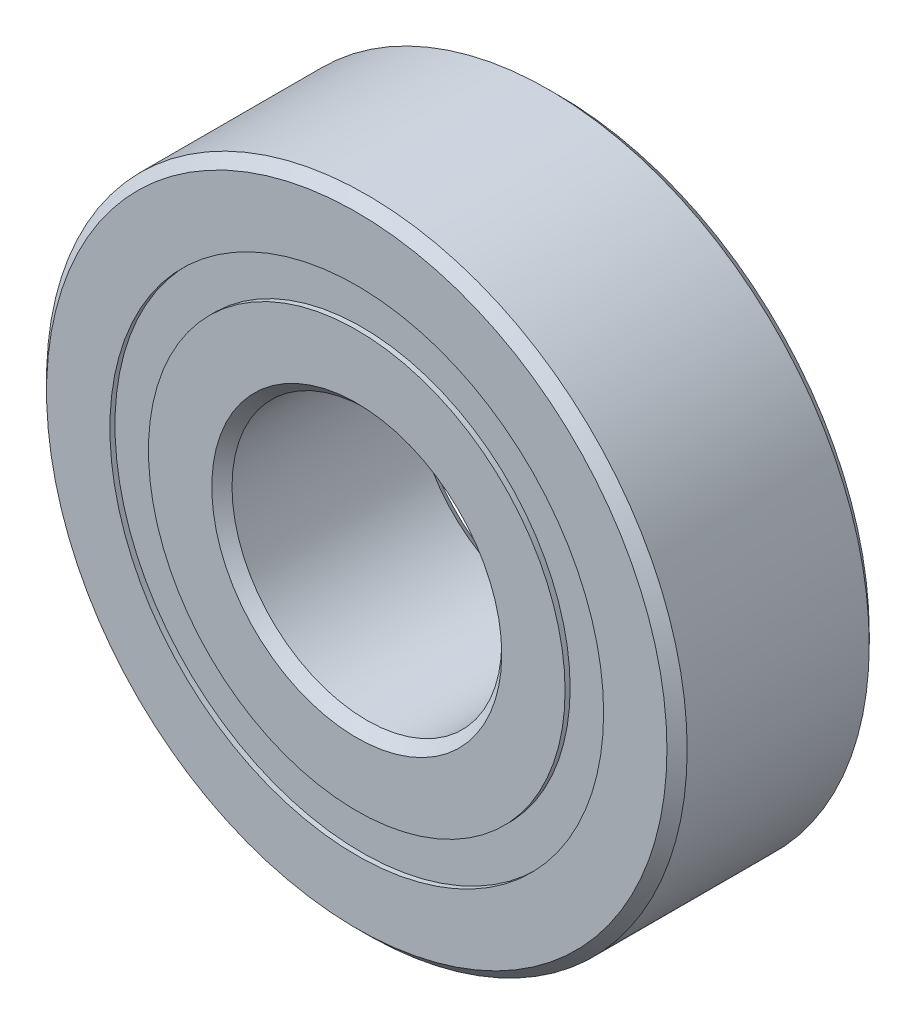
ISO-10303-21;
HEADER;
FILE_DESCRIPTION(('STEP AP214'),'2;1');
FILE_NAME('part.step','',(''),(''),'','','');
FILE_SCHEMA(('AUTOMOTIVE_DESIGN { 1 0 10303 214 1 1 1 1 }'));
ENDSEC;
DATA;
#1=APPLICATION_CONTEXT('core data for automotive mechanical design processes');
#2=APPLICATION_PROTOCOL_DEFINITION('international standard','automotive_design',2000,#1);
#3=PRODUCT_CONTEXT('',#1,'mechanical');
#4=PRODUCT('Part','Part','',(#3));
#5=PRODUCT_RELATED_PRODUCT_CATEGORY('part','',(#4));
#6=PRODUCT_DEFINITION_FORMATION('','',#4);
#7=PRODUCT_DEFINITION_CONTEXT('part definition',#1,'design');
#8=PRODUCT_DEFINITION('design','',#6,#7);
#9=PRODUCT_DEFINITION_SHAPE('','',#8);
#10=(LENGTH_UNIT() NAMED_UNIT(*) SI_UNIT(.MILLI.,.METRE.));
#11=(NAMED_UNIT(*) PLANE_ANGLE_UNIT() SI_UNIT($,.RADIAN.));
#12=(NAMED_UNIT(*) SI_UNIT($,.STERADIAN.) SOLID_ANGLE_UNIT());
#13=UNCERTAINTY_MEASURE_WITH_UNIT(LENGTH_MEASURE(1.E-05),#10,'distance_accuracy_value','');
#14=(GEOMETRIC_REPRESENTATION_CONTEXT(3) GLOBAL_UNCERTAINTY_ASSIGNED_CONTEXT((#13)) GLOBAL_UNIT_ASSIGNED_CONTEXT((#10,
#11,#12)) REPRESENTATION_CONTEXT('',''));
#15=CARTESIAN_POINT('',(0.,0.,0.));
#16=DIRECTION('',(0.,0.,1.));
#17=DIRECTION('',(1.,0.,0.));
#18=AXIS2_PLACEMENT_3D('',#15,#16,#17);
#19=CARTESIAN_POINT('',(0.,7.32142857142857,-2.85));
#20=DIRECTION('',(0.,0.,1.));
#21=DIRECTION('',(1.,0.,0.));
#22=AXIS2_PLACEMENT_3D('',#19,#20,#21);
#23=PLANE('',#22);
#24=CARTESIAN_POINT('',(0.,0.,-2.85));
#25=DIRECTION('',(0.,0.,1.));
#26=DIRECTION('',(1.,0.,0.));
#27=AXIS2_PLACEMENT_3D('',#24,#25,#26);
#28=CIRCLE('',#27,7.32142857142857);
#29=CARTESIAN_POINT('',(7.32142857142857,0.,-2.85));
#30=VERTEX_POINT('',#29);
#31=EDGE_CURVE('E55',#30,#30,#28,.T.);
#32=ORIENTED_EDGE('',*,*,#31,.F.);
#33=EDGE_LOOP('',(#32));
#34=FACE_BOUND('',#33,.T.);
#35=CARTESIAN_POINT('',(0.,0.,-2.85));
#36=DIRECTION('',(0.,0.,1.));
#37=DIRECTION('',(1.,0.,0.));
#38=AXIS2_PLACEMENT_3D('',#35,#36,#37);
#39=CIRCLE('',#38,6.17857142857143);
#40=CARTESIAN_POINT('',(6.17857142857143,0.,-2.85));
#41=VERTEX_POINT('',#40);
#42=EDGE_CURVE('E11',#41,#41,#39,.T.);
#43=ORIENTED_EDGE('',*,*,#42,.T.);
#44=EDGE_LOOP('',(#43));
#45=FACE_BOUND('',#44,.T.);
#46=ADVANCED_FACE('F41',(#34,#45),#23,.F.);
#47=CARTESIAN_POINT('',(0.,0.,3.));
#48=DIRECTION('',(0.,0.,1.));
#49=DIRECTION('',(1.,0.,0.));
#50=AXIS2_PLACEMENT_3D('',#47,#48,#49);
#51=CYLINDRICAL_SURFACE('',#50,6.17857142857143);
#52=ORIENTED_EDGE('',*,*,#42,.F.);
#53=EDGE_LOOP('',(#52));
#54=FACE_BOUND('',#53,.T.);
#55=CARTESIAN_POINT('',(0.,0.,-1.45062344873598));
#56=DIRECTION('',(0.,0.,1.));
#57=DIRECTION('',(1.,0.,0.));
#58=AXIS2_PLACEMENT_3D('',#55,#56,#57);
#59=CIRCLE('',#58,6.17857142857143);
#60=CARTESIAN_POINT('',(6.17857142857143,0.,-1.45062344873598));
#61=VERTEX_POINT('',#60);
#62=EDGE_CURVE('E47',#61,#61,#59,.T.);
#63=ORIENTED_EDGE('',*,*,#62,.T.);
#64=EDGE_LOOP('',(#63));
#65=FACE_BOUND('',#64,.T.);
#66=ADVANCED_FACE('F64',(#54,#65),#51,.F.);
#67=CARTESIAN_POINT('',(0.,7.32142857142857,-1.45062344873598));
#68=DIRECTION('',(0.,0.,-1.));
#69=DIRECTION('',(-1.,0.,0.));
#70=AXIS2_PLACEMENT_3D('',#67,#68,#69);
#71=PLANE('',#70);
#72=ORIENTED_EDGE('',*,*,#62,.F.);
#73=EDGE_LOOP('',(#72));
#74=FACE_BOUND('',#73,.T.);
#75=CARTESIAN_POINT('',(0.,0.,-1.45062344873598));
#76=DIRECTION('',(0.,0.,1.));
#77=DIRECTION('',(1.,0.,0.));
#78=AXIS2_PLACEMENT_3D('',#75,#76,#77);
#79=CIRCLE('',#78,7.32142857142857);
#80=CARTESIAN_POINT('',(7.32142857142857,0.,-1.45062344873598));
#81=VERTEX_POINT('',#80);
#82=EDGE_CURVE('E51',#81,#81,#79,.T.);
#83=ORIENTED_EDGE('',*,*,#82,.T.);
#84=EDGE_LOOP('',(#83));
#85=FACE_BOUND('',#84,.T.);
#86=ADVANCED_FACE('F68',(#74,#85),#71,.F.);
#87=CARTESIAN_POINT('',(0.,0.,3.));
#88=DIRECTION('',(0.,0.,1.));
#89=DIRECTION('',(1.,0.,0.));
#90=AXIS2_PLACEMENT_3D('',#87,#88,#89);
#91=CYLINDRICAL_SURFACE('',#90,7.32142857142857);
#92=ORIENTED_EDGE('',*,*,#82,.F.);
#93=EDGE_LOOP('',(#92));
#94=FACE_BOUND('',#93,.T.);
#95=ORIENTED_EDGE('',*,*,#31,.T.);
#96=EDGE_LOOP('',(#95));
#97=FACE_BOUND('',#96,.T.);
#98=ADVANCED_FACE('F61',(#94,#97),#91,.T.);
#99=CLOSED_SHELL('',(#46,#66,#86,#98));
#100=MANIFOLD_SOLID_BREP('B2',#99);
#101=CARTESIAN_POINT('',(0.,7.32142857142857,2.85));
#102=DIRECTION('',(0.,0.,-1.));
#103=DIRECTION('',(-1.,0.,0.));
#104=AXIS2_PLACEMENT_3D('',#101,#102,#103);
#105=PLANE('',#104);
#106=CARTESIAN_POINT('',(0.,0.,2.85));
#107=DIRECTION('',(0.,0.,1.));
#108=DIRECTION('',(1.,0.,0.));
#109=AXIS2_PLACEMENT_3D('',#106,#107,#108);
#110=CIRCLE('',#109,6.17857142857143);
#111=CARTESIAN_POINT('',(6.17857142857143,0.,2.85));
#112=VERTEX_POINT('',#111);
#113=EDGE_CURVE('E40',#112,#112,#110,.T.);
#114=ORIENTED_EDGE('',*,*,#113,.F.);
#115=EDGE_LOOP('',(#114));
#116=FACE_BOUND('',#115,.T.);
#117=CARTESIAN_POINT('',(0.,0.,2.85));
#118=DIRECTION('',(0.,0.,1.));
#119=DIRECTION('',(1.,0.,0.));
#120=AXIS2_PLACEMENT_3D('',#117,#118,#119);
#121=CIRCLE('',#120,7.32142857142857);
#122=CARTESIAN_POINT('',(7.32142857142857,0.,2.85));
#123=VERTEX_POINT('',#122);
#124=EDGE_CURVE('E122',#123,#123,#121,.T.);
#125=ORIENTED_EDGE('',*,*,#124,.T.);
#126=EDGE_LOOP('',(#125));
#127=FACE_BOUND('',#126,.T.);
#128=ADVANCED_FACE('F108',(#116,#127),#105,.F.);
#129=CARTESIAN_POINT('',(0.,0.,3.));
#130=DIRECTION('',(0.,0.,1.));
#131=DIRECTION('',(1.,0.,0.));
#132=AXIS2_PLACEMENT_3D('',#129,#130,#131);
#133=CYLINDRICAL_SURFACE('',#132,6.17857142857143);
#134=CARTESIAN_POINT('',(0.,0.,1.45062344873598));
#135=DIRECTION('',(0.,0.,1.));
#136=DIRECTION('',(1.,0.,0.));
#137=AXIS2_PLACEMENT_3D('',#134,#135,#136);
#138=CIRCLE('',#137,6.17857142857143);
#139=CARTESIAN_POINT('',(6.17857142857143,0.,1.45062344873598));
#140=VERTEX_POINT('',#139);
#141=EDGE_CURVE('E114',#140,#140,#138,.T.);
#142=ORIENTED_EDGE('',*,*,#141,.F.);
#143=EDGE_LOOP('',(#142));
#144=FACE_BOUND('',#143,.T.);
#145=ORIENTED_EDGE('',*,*,#113,.T.);
#146=EDGE_LOOP('',(#145));
#147=FACE_BOUND('',#146,.T.);
#148=ADVANCED_FACE('F137',(#144,#147),#133,.F.);
#149=CARTESIAN_POINT('',(0.,7.32142857142857,1.45062344873598));
#150=DIRECTION('',(0.,0.,1.));
#151=DIRECTION('',(1.,0.,0.));
#152=AXIS2_PLACEMENT_3D('',#149,#150,#151);
#153=PLANE('',#152);
#154=CARTESIAN_POINT('',(0.,0.,1.45062344873598));
#155=DIRECTION('',(0.,0.,1.));
#156=DIRECTION('',(1.,0.,0.));
#157=AXIS2_PLACEMENT_3D('',#154,#155,#156);
#158=CIRCLE('',#157,7.32142857142857);
#159=CARTESIAN_POINT('',(7.32142857142857,0.,1.45062344873598));
#160=VERTEX_POINT('',#159);
#161=EDGE_CURVE('E118',#160,#160,#158,.T.);
#162=ORIENTED_EDGE('',*,*,#161,.F.);
#163=EDGE_LOOP('',(#162));
#164=FACE_BOUND('',#163,.T.);
#165=ORIENTED_EDGE('',*,*,#141,.T.);
#166=EDGE_LOOP('',(#165));
#167=FACE_BOUND('',#166,.T.);
#168=ADVANCED_FACE('F132',(#164,#167),#153,.F.);
#169=CARTESIAN_POINT('',(0.,0.,3.));
#170=DIRECTION('',(0.,0.,1.));
#171=DIRECTION('',(1.,0.,0.));
#172=AXIS2_PLACEMENT_3D('',#169,#170,#171);
#173=CYLINDRICAL_SURFACE('',#172,7.32142857142857);
#174=ORIENTED_EDGE('',*,*,#124,.F.);
#175=EDGE_LOOP('',(#174));
#176=FACE_BOUND('',#175,.T.);
#177=ORIENTED_EDGE('',*,*,#161,.T.);
#178=EDGE_LOOP('',(#177));
#179=FACE_BOUND('',#178,.T.);
#180=ADVANCED_FACE('F129',(#176,#179),#173,.T.);
#181=CLOSED_SHELL('',(#128,#148,#168,#180));
#182=MANIFOLD_SOLID_BREP('B6',#181);
#183=CARTESIAN_POINT('',(-3.37499999999992,5.845671475545,0.));
#184=DIRECTION('',(0.,0.,1.));
#185=DIRECTION('',(-0.499999999999989,0.866025403784445,0.));
#186=AXIS2_PLACEMENT_3D('',#183,#184,#185);
#187=SPHERICAL_SURFACE('',#186,1.45062344873598);
#188=CARTESIAN_POINT('',(-3.37499999999992,5.845671475545,1.45062344873598));
#189=VERTEX_POINT('',#188);
#190=VERTEX_LOOP('',#189);
#191=FACE_BOUND('',#190,.T.);
#192=ADVANCED_FACE('F175',(#191),#187,.T.);
#193=CLOSED_SHELL('',(#192));
#194=MANIFOLD_SOLID_BREP('B35',#193);
#195=CARTESIAN_POINT('',(-5.84567147554492,3.37500000000007,0.));
#196=DIRECTION('',(0.,0.,1.));
#197=DIRECTION('',(-0.866025403784433,0.50000000000001,0.));
#198=AXIS2_PLACEMENT_3D('',#195,#196,#197);
#199=SPHERICAL_SURFACE('',#198,1.45062344873598);
#200=CARTESIAN_POINT('',(-5.84567147554492,3.37500000000007,1.45062344873598));
#201=VERTEX_POINT('',#200);
#202=VERTEX_LOOP('',#201);
#203=FACE_BOUND('',#202,.T.);
#204=ADVANCED_FACE('F195',(#203),#199,.T.);
#205=CLOSED_SHELL('',(#204));
#206=MANIFOLD_SOLID_BREP('B104',#205);
#207=CARTESIAN_POINT('',(-6.75,0.,0.));
#208=DIRECTION('',(0.,0.,1.));
#209=DIRECTION('',(-1.,0.,0.));
#210=AXIS2_PLACEMENT_3D('',#207,#208,#209);
#211=SPHERICAL_SURFACE('',#210,1.45062344873598);
#212=CARTESIAN_POINT('',(-6.75,0.,1.45062344873598));
#213=VERTEX_POINT('',#212);
#214=VERTEX_LOOP('',#213);
#215=FACE_BOUND('',#214,.T.);
#216=ADVANCED_FACE('F215',(#215),#211,.T.);
#217=CLOSED_SHELL('',(#216));
#218=MANIFOLD_SOLID_BREP('B171',#217);
#219=CARTESIAN_POINT('',(-5.84567147554499,-3.37499999999995,0.));
#220=DIRECTION('',(0.,0.,1.));
#221=DIRECTION('',(-0.866025403784443,-0.499999999999992,0.));
#222=AXIS2_PLACEMENT_3D('',#219,#220,#221);
#223=SPHERICAL_SURFACE('',#222,1.45062344873598);
#224=CARTESIAN_POINT('',(-5.84567147554499,-3.37499999999995,1.45062344873598));
#225=VERTEX_POINT('',#224);
#226=VERTEX_LOOP('',#225);
#227=FACE_BOUND('',#226,.T.);
#228=ADVANCED_FACE('F235',(#227),#223,.T.);
#229=CLOSED_SHELL('',(#228));
#230=MANIFOLD_SOLID_BREP('B191',#229);
#231=CARTESIAN_POINT('',(-3.37500000000005,-5.84567147554493,0.));
#232=DIRECTION('',(0.,0.,1.));
#233=DIRECTION('',(-0.500000000000007,-0.866025403784435,0.));
#234=AXIS2_PLACEMENT_3D('',#231,#232,#233);
#235=SPHERICAL_SURFACE('',#234,1.45062344873598);
#236=CARTESIAN_POINT('',(-3.37500000000005,-5.84567147554493,1.45062344873598));
#237=VERTEX_POINT('',#236);
#238=VERTEX_LOOP('',#237);
#239=FACE_BOUND('',#238,.T.);
#240=ADVANCED_FACE('F255',(#239),#235,.T.);
#241=CLOSED_SHELL('',(#240));
#242=MANIFOLD_SOLID_BREP('B211',#241);
#243=CARTESIAN_POINT('',(0.,-6.75,0.));
#244=DIRECTION('',(0.,0.,1.));
#245=DIRECTION('',(0.,-1.,0.));
#246=AXIS2_PLACEMENT_3D('',#243,#244,#245);
#247=SPHERICAL_SURFACE('',#246,1.45062344873598);
#248=CARTESIAN_POINT('',(0.,-6.75,1.45062344873598));
#249=VERTEX_POINT('',#248);
#250=VERTEX_LOOP('',#249);
#251=FACE_BOUND('',#250,.T.);
#252=ADVANCED_FACE('F275',(#251),#247,.T.);
#253=CLOSED_SHELL('',(#252));
#254=MANIFOLD_SOLID_BREP('B231',#253);
#255=CARTESIAN_POINT('',(3.37499999999997,-5.84567147554498,0.));
#256=DIRECTION('',(0.,0.,1.));
#257=DIRECTION('',(0.499999999999995,-0.866025403784442,0.));
#258=AXIS2_PLACEMENT_3D('',#255,#256,#257);
#259=SPHERICAL_SURFACE('',#258,1.45062344873598);
#260=CARTESIAN_POINT('',(3.37499999999997,-5.84567147554498,1.45062344873598));
#261=VERTEX_POINT('',#260);
#262=VERTEX_LOOP('',#261);
#263=FACE_BOUND('',#262,.T.);
#264=ADVANCED_FACE('F295',(#263),#259,.T.);
#265=CLOSED_SHELL('',(#264));
#266=MANIFOLD_SOLID_BREP('B251',#265);
#267=CARTESIAN_POINT('',(5.84567147554495,-3.37500000000003,0.));
#268=DIRECTION('',(0.,0.,1.));
#269=DIRECTION('',(0.866025403784436,-0.500000000000004,0.));
#270=AXIS2_PLACEMENT_3D('',#267,#268,#269);
#271=SPHERICAL_SURFACE('',#270,1.45062344873598);
#272=CARTESIAN_POINT('',(5.84567147554495,-3.37500000000003,1.45062344873598));
#273=VERTEX_POINT('',#272);
#274=VERTEX_LOOP('',#273);
#275=FACE_BOUND('',#274,.T.);
#276=ADVANCED_FACE('F315',(#275),#271,.T.);
#277=CLOSED_SHELL('',(#276));
#278=MANIFOLD_SOLID_BREP('B271',#277);
#279=CARTESIAN_POINT('',(6.75,0.,0.));
#280=DIRECTION('',(0.,0.,1.));
#281=DIRECTION('',(1.,0.,0.));
#282=AXIS2_PLACEMENT_3D('',#279,#280,#281);
#283=SPHERICAL_SURFACE('',#282,1.45062344873598);
#284=CARTESIAN_POINT('',(6.75,0.,1.45062344873598));
#285=VERTEX_POINT('',#284);
#286=VERTEX_LOOP('',#285);
#287=FACE_BOUND('',#286,.T.);
#288=ADVANCED_FACE('F335',(#287),#283,.T.);
#289=CLOSED_SHELL('',(#288));
#290=MANIFOLD_SOLID_BREP('B291',#289);
#291=CARTESIAN_POINT('',(5.84567147554497,3.37499999999999,0.));
#292=DIRECTION('',(0.,0.,1.));
#293=DIRECTION('',(0.86602540378444,0.499999999999998,0.));
#294=AXIS2_PLACEMENT_3D('',#291,#292,#293);
#295=SPHERICAL_SURFACE('',#294,1.45062344873598);
#296=CARTESIAN_POINT('',(5.84567147554497,3.37499999999999,1.45062344873598));
#297=VERTEX_POINT('',#296);
#298=VERTEX_LOOP('',#297);
#299=FACE_BOUND('',#298,.T.);
#300=ADVANCED_FACE('F355',(#299),#295,.T.);
#301=CLOSED_SHELL('',(#300));
#302=MANIFOLD_SOLID_BREP('B311',#301);
#303=CARTESIAN_POINT('',(3.37500000000001,5.84567147554496,0.));
#304=DIRECTION('',(0.,0.,1.));
#305=DIRECTION('',(0.500000000000001,0.866025403784438,0.));
#306=AXIS2_PLACEMENT_3D('',#303,#304,#305);
#307=SPHERICAL_SURFACE('',#306,1.45062344873598);
#308=CARTESIAN_POINT('',(3.37500000000001,5.84567147554496,1.45062344873598));
#309=VERTEX_POINT('',#308);
#310=VERTEX_LOOP('',#309);
#311=FACE_BOUND('',#310,.T.);
#312=ADVANCED_FACE('F375',(#311),#307,.T.);
#313=CLOSED_SHELL('',(#312));
#314=MANIFOLD_SOLID_BREP('B331',#313);
#315=CARTESIAN_POINT('',(0.,6.75,0.));
#316=DIRECTION('',(0.,0.,1.));
#317=DIRECTION('',(0.,1.,0.));
#318=AXIS2_PLACEMENT_3D('',#315,#316,#317);
#319=SPHERICAL_SURFACE('',#318,1.45062344873598);
#320=CARTESIAN_POINT('',(0.,6.75,1.45062344873598));
#321=VERTEX_POINT('',#320);
#322=VERTEX_LOOP('',#321);
#323=FACE_BOUND('',#322,.T.);
#324=ADVANCED_FACE('F397',(#323),#319,.T.);
#325=CLOSED_SHELL('',(#324));
#326=MANIFOLD_SOLID_BREP('B351',#325);
#327=CARTESIAN_POINT('',(0.,6.17857142857143,3.));
#328=DIRECTION('',(0.,0.,-1.));
#329=DIRECTION('',(-1.,0.,0.));
#330=AXIS2_PLACEMENT_3D('',#327,#328,#329);
#331=PLANE('',#330);
#332=CARTESIAN_POINT('',(0.,0.,3.));
#333=DIRECTION('',(0.,0.,1.));
#334=DIRECTION('',(1.,0.,0.));
#335=AXIS2_PLACEMENT_3D('',#332,#333,#334);
#336=CIRCLE('',#335,4.3);
#337=CARTESIAN_POINT('',(4.3,0.,3.));
#338=VERTEX_POINT('',#337);
#339=EDGE_CURVE('E444',#338,#338,#336,.T.);
#340=ORIENTED_EDGE('',*,*,#339,.F.);
#341=EDGE_LOOP('',(#340));
#342=FACE_BOUND('',#341,.T.);
#343=CARTESIAN_POINT('',(0.,0.,3.));
#344=DIRECTION('',(0.,0.,1.));
#345=DIRECTION('',(1.,0.,0.));
#346=AXIS2_PLACEMENT_3D('',#343,#344,#345);
#347=CIRCLE('',#346,6.17857142857143);
#348=CARTESIAN_POINT('',(6.17857142857143,0.,3.));
#349=VERTEX_POINT('',#348);
#350=EDGE_CURVE('E396',#349,#349,#347,.T.);
#351=ORIENTED_EDGE('',*,*,#350,.T.);
#352=EDGE_LOOP('',(#351));
#353=FACE_BOUND('',#352,.T.);
#354=ADVANCED_FACE('F416',(#342,#353),#331,.F.);
#355=CARTESIAN_POINT('',(0.,0.,3.));
#356=DIRECTION('',(0.,0.,1.));
#357=DIRECTION('',(1.,0.,0.));
#358=AXIS2_PLACEMENT_3D('',#355,#356,#357);
#359=CYLINDRICAL_SURFACE('',#358,6.17857142857143);
#360=ORIENTED_EDGE('',*,*,#350,.F.);
#361=EDGE_LOOP('',(#360));
#362=FACE_BOUND('',#361,.T.);
#363=CARTESIAN_POINT('',(0.,0.,1.33333333333333));
#364=DIRECTION('',(0.,0.,1.));
#365=DIRECTION('',(1.,0.,0.));
#366=AXIS2_PLACEMENT_3D('',#363,#364,#365);
#367=CIRCLE('',#366,6.17857142857143);
#368=CARTESIAN_POINT('',(6.17857142857143,0.,1.33333333333333));
#369=VERTEX_POINT('',#368);
#370=EDGE_CURVE('E422',#369,#369,#367,.T.);
#371=ORIENTED_EDGE('',*,*,#370,.T.);
#372=EDGE_LOOP('',(#371));
#373=FACE_BOUND('',#372,.T.);
#374=ADVANCED_FACE('F451',(#362,#373),#359,.T.);
#375=CARTESIAN_POINT('',(0.,0.,0.));
#376=DIRECTION('',(0.,0.,1.));
#377=DIRECTION('',(1.,0.,0.));
#378=AXIS2_PLACEMENT_3D('',#375,#376,#377);
#379=TOROIDAL_SURFACE('',#378,6.74999999999999,1.45062344873598);
#380=ORIENTED_EDGE('',*,*,#370,.F.);
#381=EDGE_LOOP('',(#380));
#382=FACE_BOUND('',#381,.T.);
#383=CARTESIAN_POINT('',(0.,0.,-1.33333333333333));
#384=DIRECTION('',(0.,0.,1.));
#385=DIRECTION('',(1.,0.,0.));
#386=AXIS2_PLACEMENT_3D('',#383,#384,#385);
#387=CIRCLE('',#386,6.17857142857143);
#388=CARTESIAN_POINT('',(6.17857142857143,0.,-1.33333333333333));
#389=VERTEX_POINT('',#388);
#390=EDGE_CURVE('E426',#389,#389,#387,.T.);
#391=ORIENTED_EDGE('',*,*,#390,.T.);
#392=EDGE_LOOP('',(#391));
#393=FACE_BOUND('',#392,.T.);
#394=ADVANCED_FACE('F455',(#382,#393),#379,.F.);
#395=CARTESIAN_POINT('',(0.,0.,3.));
#396=DIRECTION('',(0.,0.,1.));
#397=DIRECTION('',(1.,0.,0.));
#398=AXIS2_PLACEMENT_3D('',#395,#396,#397);
#399=CYLINDRICAL_SURFACE('',#398,6.17857142857143);
#400=ORIENTED_EDGE('',*,*,#390,.F.);
#401=EDGE_LOOP('',(#400));
#402=FACE_BOUND('',#401,.T.);
#403=CARTESIAN_POINT('',(0.,0.,-3.));
#404=DIRECTION('',(0.,0.,1.));
#405=DIRECTION('',(1.,0.,0.));
#406=AXIS2_PLACEMENT_3D('',#403,#404,#405);
#407=CIRCLE('',#406,6.17857142857143);
#408=CARTESIAN_POINT('',(6.17857142857143,0.,-3.));
#409=VERTEX_POINT('',#408);
#410=EDGE_CURVE('E430',#409,#409,#407,.T.);
#411=ORIENTED_EDGE('',*,*,#410,.T.);
#412=EDGE_LOOP('',(#411));
#413=FACE_BOUND('',#412,.T.);
#414=ADVANCED_FACE('F460',(#402,#413),#399,.T.);
#415=CARTESIAN_POINT('',(0.,4.3,-3.));
#416=DIRECTION('',(0.,0.,1.));
#417=DIRECTION('',(1.,0.,0.));
#418=AXIS2_PLACEMENT_3D('',#415,#416,#417);
#419=PLANE('',#418);
#420=ORIENTED_EDGE('',*,*,#410,.F.);
#421=EDGE_LOOP('',(#420));
#422=FACE_BOUND('',#421,.T.);
#423=CARTESIAN_POINT('',(0.,0.,-3.));
#424=DIRECTION('',(0.,0.,1.));
#425=DIRECTION('',(1.,0.,0.));
#426=AXIS2_PLACEMENT_3D('',#423,#424,#425);
#427=CIRCLE('',#426,4.3);
#428=CARTESIAN_POINT('',(4.3,0.,-3.));
#429=VERTEX_POINT('',#428);
#430=EDGE_CURVE('E435',#429,#429,#427,.T.);
#431=ORIENTED_EDGE('',*,*,#430,.T.);
#432=EDGE_LOOP('',(#431));
#433=FACE_BOUND('',#432,.T.);
#434=ADVANCED_FACE('F466',(#422,#433),#419,.F.);
#435=CARTESIAN_POINT('',(0.,0.,-2.7));
#436=DIRECTION('',(0.,0.,-1.));
#437=DIRECTION('',(-1.,0.,0.));
#438=AXIS2_PLACEMENT_3D('',#435,#436,#437);
#439=CONICAL_SURFACE('',#438,4.,0.785398163397445);
#440=ORIENTED_EDGE('',*,*,#430,.F.);
#441=EDGE_LOOP('',(#440));
#442=FACE_BOUND('',#441,.T.);
#443=CARTESIAN_POINT('',(0.,0.,-2.7));
#444=DIRECTION('',(0.,0.,1.));
#445=DIRECTION('',(1.,0.,0.));
#446=AXIS2_PLACEMENT_3D('',#443,#444,#445);
#447=CIRCLE('',#446,4.);
#448=CARTESIAN_POINT('',(4.,0.,-2.7));
#449=VERTEX_POINT('',#448);
#450=EDGE_CURVE('E438',#449,#449,#447,.T.);
#451=ORIENTED_EDGE('',*,*,#450,.T.);
#452=EDGE_LOOP('',(#451));
#453=FACE_BOUND('',#452,.T.);
#454=ADVANCED_FACE('F470',(#442,#453),#439,.F.);
#455=CARTESIAN_POINT('',(0.,0.,3.));
#456=DIRECTION('',(0.,0.,1.));
#457=DIRECTION('',(1.,0.,0.));
#458=AXIS2_PLACEMENT_3D('',#455,#456,#457);
#459=CYLINDRICAL_SURFACE('',#458,4.);
#460=ORIENTED_EDGE('',*,*,#450,.F.);
#461=EDGE_LOOP('',(#460));
#462=FACE_BOUND('',#461,.T.);
#463=CARTESIAN_POINT('',(0.,0.,2.7));
#464=DIRECTION('',(0.,0.,1.));
#465=DIRECTION('',(1.,0.,0.));
#466=AXIS2_PLACEMENT_3D('',#463,#464,#465);
#467=CIRCLE('',#466,4.);
#468=CARTESIAN_POINT('',(4.,0.,2.7));
#469=VERTEX_POINT('',#468);
#470=EDGE_CURVE('E441',#469,#469,#467,.T.);
#471=ORIENTED_EDGE('',*,*,#470,.T.);
#472=EDGE_LOOP('',(#471));
#473=FACE_BOUND('',#472,.T.);
#474=ADVANCED_FACE('F474',(#462,#473),#459,.F.);
#475=CARTESIAN_POINT('',(0.,0.,3.));
#476=DIRECTION('',(0.,0.,1.));
#477=DIRECTION('',(1.,0.,0.));
#478=AXIS2_PLACEMENT_3D('',#475,#476,#477);
#479=CONICAL_SURFACE('',#478,4.3,0.78539816339745);
#480=ORIENTED_EDGE('',*,*,#470,.F.);
#481=EDGE_LOOP('',(#480));
#482=FACE_BOUND('',#481,.T.);
#483=ORIENTED_EDGE('',*,*,#339,.T.);
#484=EDGE_LOOP('',(#483));
#485=FACE_BOUND('',#484,.T.);
#486=ADVANCED_FACE('F448',(#482,#485),#479,.F.);
#487=CLOSED_SHELL('',(#354,#374,#394,#414,#434,#454,#474,#486));
#488=MANIFOLD_SOLID_BREP('B371',#487);
#489=CARTESIAN_POINT('',(0.,0.,2.7));
#490=DIRECTION('',(0.,0.,-1.));
#491=DIRECTION('',(-1.,0.,0.));
#492=AXIS2_PLACEMENT_3D('',#489,#490,#491);
#493=CONICAL_SURFACE('',#492,9.5,0.785398163397445);
#494=CARTESIAN_POINT('',(0.,0.,3.));
#495=DIRECTION('',(0.,0.,1.));
#496=DIRECTION('',(1.,0.,0.));
#497=AXIS2_PLACEMENT_3D('',#494,#495,#496);
#498=CIRCLE('',#497,9.2);
#499=CARTESIAN_POINT('',(9.2,0.,3.));
#500=VERTEX_POINT('',#499);
#501=EDGE_CURVE('E565',#500,#500,#498,.T.);
#502=ORIENTED_EDGE('',*,*,#501,.F.);
#503=EDGE_LOOP('',(#502));
#504=FACE_BOUND('',#503,.T.);
#505=CARTESIAN_POINT('',(0.,0.,2.7));
#506=DIRECTION('',(0.,0.,1.));
#507=DIRECTION('',(1.,0.,0.));
#508=AXIS2_PLACEMENT_3D('',#505,#506,#507);
#509=CIRCLE('',#508,9.5);
#510=CARTESIAN_POINT('',(9.5,0.,2.7));
#511=VERTEX_POINT('',#510);
#512=EDGE_CURVE('E415',#511,#511,#509,.T.);
#513=ORIENTED_EDGE('',*,*,#512,.T.);
#514=EDGE_LOOP('',(#513));
#515=FACE_BOUND('',#514,.T.);
#516=ADVANCED_FACE('F537',(#504,#515),#493,.T.);
#517=CARTESIAN_POINT('',(0.,0.,3.));
#518=DIRECTION('',(0.,0.,1.));
#519=DIRECTION('',(1.,0.,0.));
#520=AXIS2_PLACEMENT_3D('',#517,#518,#519);
#521=CYLINDRICAL_SURFACE('',#520,9.5);
#522=ORIENTED_EDGE('',*,*,#512,.F.);
#523=EDGE_LOOP('',(#522));
#524=FACE_BOUND('',#523,.T.);
#525=CARTESIAN_POINT('',(0.,0.,-2.7));
#526=DIRECTION('',(0.,0.,1.));
#527=DIRECTION('',(1.,0.,0.));
#528=AXIS2_PLACEMENT_3D('',#525,#526,#527);
#529=CIRCLE('',#528,9.5);
#530=CARTESIAN_POINT('',(9.5,0.,-2.7));
#531=VERTEX_POINT('',#530);
#532=EDGE_CURVE('E543',#531,#531,#529,.T.);
#533=ORIENTED_EDGE('',*,*,#532,.T.);
#534=EDGE_LOOP('',(#533));
#535=FACE_BOUND('',#534,.T.);
#536=ADVANCED_FACE('F572',(#524,#535),#521,.T.);
#537=CARTESIAN_POINT('',(0.,0.,-3.));
#538=DIRECTION('',(0.,0.,1.));
#539=DIRECTION('',(1.,0.,0.));
#540=AXIS2_PLACEMENT_3D('',#537,#538,#539);
#541=CONICAL_SURFACE('',#540,9.2,0.785398163397445);
#542=ORIENTED_EDGE('',*,*,#532,.F.);
#543=EDGE_LOOP('',(#542));
#544=FACE_BOUND('',#543,.T.);
#545=CARTESIAN_POINT('',(0.,0.,-3.));
#546=DIRECTION('',(0.,0.,1.));
#547=DIRECTION('',(1.,0.,0.));
#548=AXIS2_PLACEMENT_3D('',#545,#546,#547);
#549=CIRCLE('',#548,9.2);
#550=CARTESIAN_POINT('',(9.2,0.,-3.));
#551=VERTEX_POINT('',#550);
#552=EDGE_CURVE('E547',#551,#551,#549,.T.);
#553=ORIENTED_EDGE('',*,*,#552,.T.);
#554=EDGE_LOOP('',(#553));
#555=FACE_BOUND('',#554,.T.);
#556=ADVANCED_FACE('F576',(#544,#555),#541,.T.);
#557=CARTESIAN_POINT('',(0.,9.2,-3.));
#558=DIRECTION('',(0.,0.,1.));
#559=DIRECTION('',(1.,0.,0.));
#560=AXIS2_PLACEMENT_3D('',#557,#558,#559);
#561=PLANE('',#560);
#562=ORIENTED_EDGE('',*,*,#552,.F.);
#563=EDGE_LOOP('',(#562));
#564=FACE_BOUND('',#563,.T.);
#565=CARTESIAN_POINT('',(0.,0.,-3.));
#566=DIRECTION('',(0.,0.,1.));
#567=DIRECTION('',(1.,0.,0.));
#568=AXIS2_PLACEMENT_3D('',#565,#566,#567);
#569=CIRCLE('',#568,7.32142857142857);
#570=CARTESIAN_POINT('',(7.32142857142857,0.,-3.));
#571=VERTEX_POINT('',#570);
#572=EDGE_CURVE('E551',#571,#571,#569,.T.);
#573=ORIENTED_EDGE('',*,*,#572,.T.);
#574=EDGE_LOOP('',(#573));
#575=FACE_BOUND('',#574,.T.);
#576=ADVANCED_FACE('F581',(#564,#575),#561,.F.);
#577=CARTESIAN_POINT('',(0.,0.,3.));
#578=DIRECTION('',(0.,0.,1.));
#579=DIRECTION('',(1.,0.,0.));
#580=AXIS2_PLACEMENT_3D('',#577,#578,#579);
#581=CYLINDRICAL_SURFACE('',#580,7.32142857142857);
#582=ORIENTED_EDGE('',*,*,#572,.F.);
#583=EDGE_LOOP('',(#582));
#584=FACE_BOUND('',#583,.T.);
#585=CARTESIAN_POINT('',(0.,0.,-1.33333333333333));
#586=DIRECTION('',(0.,0.,1.));
#587=DIRECTION('',(1.,0.,0.));
#588=AXIS2_PLACEMENT_3D('',#585,#586,#587);
#589=CIRCLE('',#588,7.32142857142857);
#590=CARTESIAN_POINT('',(7.32142857142857,0.,-1.33333333333333));
#591=VERTEX_POINT('',#590);
#592=EDGE_CURVE('E556',#591,#591,#589,.T.);
#593=ORIENTED_EDGE('',*,*,#592,.T.);
#594=EDGE_LOOP('',(#593));
#595=FACE_BOUND('',#594,.T.);
#596=ADVANCED_FACE('F587',(#584,#595),#581,.F.);
#597=CARTESIAN_POINT('',(0.,0.,0.));
#598=DIRECTION('',(0.,0.,1.));
#599=DIRECTION('',(1.,0.,0.));
#600=AXIS2_PLACEMENT_3D('',#597,#598,#599);
#601=TOROIDAL_SURFACE('',#600,6.75,1.45062344873598);
#602=ORIENTED_EDGE('',*,*,#592,.F.);
#603=EDGE_LOOP('',(#602));
#604=FACE_BOUND('',#603,.T.);
#605=CARTESIAN_POINT('',(0.,0.,1.33333333333333));
#606=DIRECTION('',(0.,0.,1.));
#607=DIRECTION('',(1.,0.,0.));
#608=AXIS2_PLACEMENT_3D('',#605,#606,#607);
#609=CIRCLE('',#608,7.32142857142857);
#610=CARTESIAN_POINT('',(7.32142857142857,0.,1.33333333333333));
#611=VERTEX_POINT('',#610);
#612=EDGE_CURVE('E559',#611,#611,#609,.T.);
#613=ORIENTED_EDGE('',*,*,#612,.T.);
#614=EDGE_LOOP('',(#613));
#615=FACE_BOUND('',#614,.T.);
#616=ADVANCED_FACE('F591',(#604,#615),#601,.F.);
#617=CARTESIAN_POINT('',(0.,0.,3.));
#618=DIRECTION('',(0.,0.,1.));
#619=DIRECTION('',(1.,0.,0.));
#620=AXIS2_PLACEMENT_3D('',#617,#618,#619);
#621=CYLINDRICAL_SURFACE('',#620,7.32142857142857);
#622=ORIENTED_EDGE('',*,*,#612,.F.);
#623=EDGE_LOOP('',(#622));
#624=FACE_BOUND('',#623,.T.);
#625=CARTESIAN_POINT('',(0.,0.,3.));
#626=DIRECTION('',(0.,0.,1.));
#627=DIRECTION('',(1.,0.,0.));
#628=AXIS2_PLACEMENT_3D('',#625,#626,#627);
#629=CIRCLE('',#628,7.32142857142857);
#630=CARTESIAN_POINT('',(7.32142857142857,0.,3.));
#631=VERTEX_POINT('',#630);
#632=EDGE_CURVE('E562',#631,#631,#629,.T.);
#633=ORIENTED_EDGE('',*,*,#632,.T.);
#634=EDGE_LOOP('',(#633));
#635=FACE_BOUND('',#634,.T.);
#636=ADVANCED_FACE('F595',(#624,#635),#621,.F.);
#637=CARTESIAN_POINT('',(0.,9.2,3.));
#638=DIRECTION('',(0.,0.,-1.));
#639=DIRECTION('',(-1.,0.,0.));
#640=AXIS2_PLACEMENT_3D('',#637,#638,#639);
#641=PLANE('',#640);
#642=ORIENTED_EDGE('',*,*,#632,.F.);
#643=EDGE_LOOP('',(#642));
#644=FACE_BOUND('',#643,.T.);
#645=ORIENTED_EDGE('',*,*,#501,.T.);
#646=EDGE_LOOP('',(#645));
#647=FACE_BOUND('',#646,.T.);
#648=ADVANCED_FACE('F569',(#644,#647),#641,.F.);
#649=CLOSED_SHELL('',(#516,#536,#556,#576,#596,#616,#636,#648));
#650=MANIFOLD_SOLID_BREP('B391',#649);
#651=ADVANCED_BREP_SHAPE_REPRESENTATION('',(#18,#100,#182,#194,#206,#218,#230,#242,#254,#266,
#278,#290,#302,#314,#326,#488,#650),#14);
#652=SHAPE_DEFINITION_REPRESENTATION(#9,#651);
ENDSEC;
END-ISO-10303-21;
